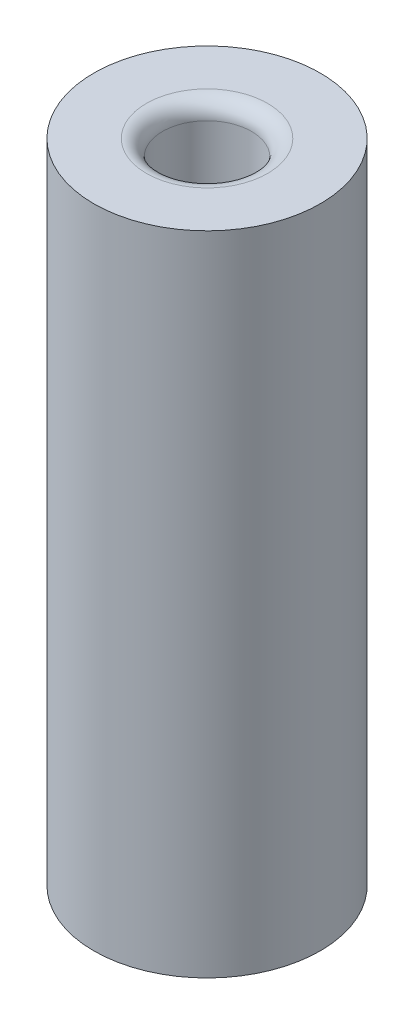
ISO-10303-21;
HEADER;
FILE_DESCRIPTION(('STEP AP214'),'2;1');
FILE_NAME('part.step','',(''),(''),'','','');
FILE_SCHEMA(('AUTOMOTIVE_DESIGN { 1 0 10303 214 1 1 1 1 }'));
ENDSEC;
DATA;
#1=APPLICATION_CONTEXT('core data for automotive mechanical design processes');
#2=APPLICATION_PROTOCOL_DEFINITION('international standard','automotive_design',2000,#1);
#3=PRODUCT_CONTEXT('',#1,'mechanical');
#4=PRODUCT('Part','Part','',(#3));
#5=PRODUCT_RELATED_PRODUCT_CATEGORY('part','',(#4));
#6=PRODUCT_DEFINITION_FORMATION('','',#4);
#7=PRODUCT_DEFINITION_CONTEXT('part definition',#1,'design');
#8=PRODUCT_DEFINITION('design','',#6,#7);
#9=PRODUCT_DEFINITION_SHAPE('','',#8);
#10=(LENGTH_UNIT() NAMED_UNIT(*) SI_UNIT(.MILLI.,.METRE.));
#11=(NAMED_UNIT(*) PLANE_ANGLE_UNIT() SI_UNIT($,.RADIAN.));
#12=(NAMED_UNIT(*) SI_UNIT($,.STERADIAN.) SOLID_ANGLE_UNIT());
#13=UNCERTAINTY_MEASURE_WITH_UNIT(LENGTH_MEASURE(1.E-05),#10,'distance_accuracy_value','');
#14=(GEOMETRIC_REPRESENTATION_CONTEXT(3) GLOBAL_UNCERTAINTY_ASSIGNED_CONTEXT((#13)) GLOBAL_UNIT_ASSIGNED_CONTEXT((#10,
#11,#12)) REPRESENTATION_CONTEXT('',''));
#15=CARTESIAN_POINT('',(0.,0.,0.));
#16=DIRECTION('',(0.,0.,1.));
#17=DIRECTION('',(1.,0.,0.));
#18=AXIS2_PLACEMENT_3D('',#15,#16,#17);
#19=CARTESIAN_POINT('',(0.,2.159,0.));
#20=DIRECTION('',(0.,-1.,0.));
#21=DIRECTION('',(0.,0.,-1.));
#22=AXIS2_PLACEMENT_3D('',#19,#20,#21);
#23=CYLINDRICAL_SURFACE('',#22,0.3556);
#24=CARTESIAN_POINT('',(0.,0.,0.));
#25=DIRECTION('',(0.,1.,0.));
#26=DIRECTION('',(0.,0.,1.));
#27=AXIS2_PLACEMENT_3D('',#24,#25,#26);
#28=CIRCLE('',#27,0.3556);
#29=CARTESIAN_POINT('',(0.,0.,0.3556));
#30=VERTEX_POINT('',#29);
#31=EDGE_CURVE('E51',#30,#30,#28,.T.);
#32=ORIENTED_EDGE('',*,*,#31,.T.);
#33=EDGE_LOOP('',(#32));
#34=FACE_BOUND('',#33,.T.);
#35=CARTESIAN_POINT('',(0.,2.032,0.));
#36=DIRECTION('',(0.,1.,0.));
#37=DIRECTION('',(0.,0.,1.));
#38=AXIS2_PLACEMENT_3D('',#35,#36,#37);
#39=CIRCLE('',#38,0.3556);
#40=CARTESIAN_POINT('',(0.,2.032,0.3556));
#41=VERTEX_POINT('',#40);
#42=EDGE_CURVE('E61',#41,#41,#39,.T.);
#43=ORIENTED_EDGE('',*,*,#42,.F.);
#44=EDGE_LOOP('',(#43));
#45=FACE_BOUND('',#44,.T.);
#46=ADVANCED_FACE('F38',(#34,#45),#23,.T.);
#47=CARTESIAN_POINT('',(0.,2.159,0.));
#48=DIRECTION('',(0.,-1.,0.));
#49=DIRECTION('',(0.,0.,-1.));
#50=AXIS2_PLACEMENT_3D('',#47,#48,#49);
#51=CYLINDRICAL_SURFACE('',#50,0.1397);
#52=CARTESIAN_POINT('',(0.,1.9812,0.));
#53=DIRECTION('',(0.,1.,0.));
#54=DIRECTION('',(0.,0.,1.));
#55=AXIS2_PLACEMENT_3D('',#52,#53,#54);
#56=CIRCLE('',#55,0.1397);
#57=CARTESIAN_POINT('',(0.,1.9812,0.1397));
#58=VERTEX_POINT('',#57);
#59=EDGE_CURVE('E46',#58,#58,#56,.T.);
#60=ORIENTED_EDGE('',*,*,#59,.T.);
#61=EDGE_LOOP('',(#60));
#62=FACE_BOUND('',#61,.T.);
#63=CARTESIAN_POINT('',(0.,0.,0.));
#64=DIRECTION('',(0.,1.,0.));
#65=DIRECTION('',(0.,0.,1.));
#66=AXIS2_PLACEMENT_3D('',#63,#64,#65);
#67=CIRCLE('',#66,0.1397);
#68=CARTESIAN_POINT('',(0.,0.,0.1397));
#69=VERTEX_POINT('',#68);
#70=EDGE_CURVE('E56',#69,#69,#67,.T.);
#71=ORIENTED_EDGE('',*,*,#70,.F.);
#72=EDGE_LOOP('',(#71));
#73=FACE_BOUND('',#72,.T.);
#74=ADVANCED_FACE('F68',(#62,#73),#51,.F.);
#75=CARTESIAN_POINT('',(0.,0.,0.));
#76=DIRECTION('',(0.,1.,0.));
#77=DIRECTION('',(0.,0.,1.));
#78=AXIS2_PLACEMENT_3D('',#75,#76,#77);
#79=PLANE('',#78);
#80=ORIENTED_EDGE('',*,*,#31,.F.);
#81=EDGE_LOOP('',(#80));
#82=FACE_BOUND('',#81,.T.);
#83=ORIENTED_EDGE('',*,*,#70,.T.);
#84=EDGE_LOOP('',(#83));
#85=FACE_BOUND('',#84,.T.);
#86=ADVANCED_FACE('F73',(#82,#85),#79,.F.);
#87=CARTESIAN_POINT('',(0.,2.032,0.));
#88=DIRECTION('',(0.,1.,0.));
#89=DIRECTION('',(0.,0.,1.));
#90=AXIS2_PLACEMENT_3D('',#87,#88,#89);
#91=PLANE('',#90);
#92=CARTESIAN_POINT('',(0.,2.032,0.));
#93=DIRECTION('',(0.,1.,0.));
#94=DIRECTION('',(0.,0.,1.));
#95=AXIS2_PLACEMENT_3D('',#92,#93,#94);
#96=CIRCLE('',#95,0.1905);
#97=CARTESIAN_POINT('',(0.,2.032,0.1905));
#98=VERTEX_POINT('',#97);
#99=EDGE_CURVE('E10',#98,#98,#96,.F.);
#100=ORIENTED_EDGE('',*,*,#99,.T.);
#101=EDGE_LOOP('',(#100));
#102=FACE_BOUND('',#101,.T.);
#103=ORIENTED_EDGE('',*,*,#42,.T.);
#104=EDGE_LOOP('',(#103));
#105=FACE_BOUND('',#104,.T.);
#106=ADVANCED_FACE('F65',(#102,#105),#91,.T.);
#107=CARTESIAN_POINT('',(0.,1.9812,0.));
#108=DIRECTION('',(0.,1.,0.));
#109=DIRECTION('',(0.,0.,1.));
#110=AXIS2_PLACEMENT_3D('',#107,#108,#109);
#111=TOROIDAL_SURFACE('',#110,0.1905,0.0508);
#112=ORIENTED_EDGE('',*,*,#99,.F.);
#113=EDGE_LOOP('',(#112));
#114=FACE_BOUND('',#113,.T.);
#115=ORIENTED_EDGE('',*,*,#59,.F.);
#116=EDGE_LOOP('',(#115));
#117=FACE_BOUND('',#116,.T.);
#118=ADVANCED_FACE('F40',(#114,#117),#111,.T.);
#119=CLOSED_SHELL('',(#46,#74,#86,#106,#118));
#120=MANIFOLD_SOLID_BREP('B2',#119);
#121=ADVANCED_BREP_SHAPE_REPRESENTATION('',(#18,#120),#14);
#122=SHAPE_DEFINITION_REPRESENTATION(#9,#121);
ENDSEC;
END-ISO-10303-21;
